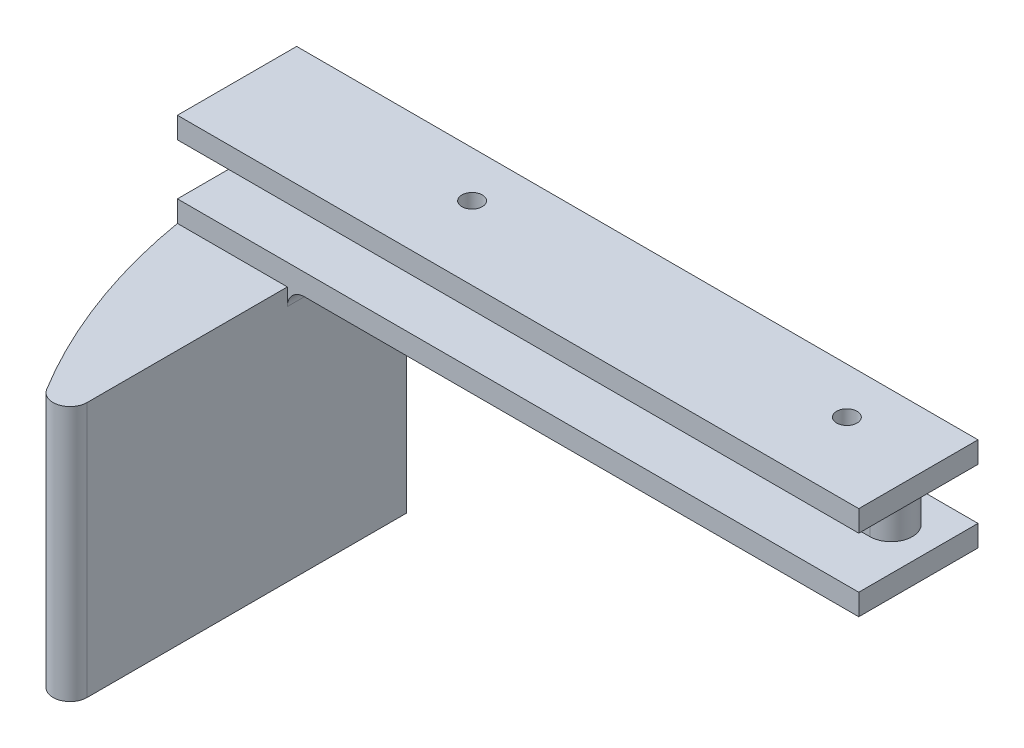
ISO-10303-21;
HEADER;
FILE_DESCRIPTION(('STEP AP214'),'2;1');
FILE_NAME('part.step','',(''),(''),'','','');
FILE_SCHEMA(('AUTOMOTIVE_DESIGN { 1 0 10303 214 1 1 1 1 }'));
ENDSEC;
DATA;
#1=APPLICATION_CONTEXT('core data for automotive mechanical design processes');
#2=APPLICATION_PROTOCOL_DEFINITION('international standard','automotive_design',2000,#1);
#3=PRODUCT_CONTEXT('',#1,'mechanical');
#4=PRODUCT('Part','Part','',(#3));
#5=PRODUCT_RELATED_PRODUCT_CATEGORY('part','',(#4));
#6=PRODUCT_DEFINITION_FORMATION('','',#4);
#7=PRODUCT_DEFINITION_CONTEXT('part definition',#1,'design');
#8=PRODUCT_DEFINITION('design','',#6,#7);
#9=PRODUCT_DEFINITION_SHAPE('','',#8);
#10=(LENGTH_UNIT() NAMED_UNIT(*) SI_UNIT(.MILLI.,.METRE.));
#11=(NAMED_UNIT(*) PLANE_ANGLE_UNIT() SI_UNIT($,.RADIAN.));
#12=(NAMED_UNIT(*) SI_UNIT($,.STERADIAN.) SOLID_ANGLE_UNIT());
#13=UNCERTAINTY_MEASURE_WITH_UNIT(LENGTH_MEASURE(1.E-05),#10,'distance_accuracy_value','');
#14=(GEOMETRIC_REPRESENTATION_CONTEXT(3) GLOBAL_UNCERTAINTY_ASSIGNED_CONTEXT((#13)) GLOBAL_UNIT_ASSIGNED_CONTEXT((#10,
#11,#12)) REPRESENTATION_CONTEXT('',''));
#15=CARTESIAN_POINT('',(0.,0.,0.));
#16=DIRECTION('',(0.,0.,1.));
#17=DIRECTION('',(1.,0.,0.));
#18=AXIS2_PLACEMENT_3D('',#15,#16,#17);
#19=CARTESIAN_POINT('',(0.,-10.795,0.));
#20=DIRECTION('',(0.,1.,0.));
#21=DIRECTION('',(0.,0.,-1.));
#22=AXIS2_PLACEMENT_3D('',#19,#20,#21);
#23=PLANE('',#22);
#24=CARTESIAN_POINT('',(88.9,-10.795,-10.922));
#25=DIRECTION('',(0.,-1.,0.));
#26=DIRECTION('',(0.,0.,-1.));
#27=AXIS2_PLACEMENT_3D('',#24,#25,#26);
#28=CIRCLE('',#27,1.52399999999999);
#29=CARTESIAN_POINT('',(88.9,-10.795,-12.446));
#30=VERTEX_POINT('',#29);
#31=EDGE_CURVE('E515',#30,#30,#28,.T.);
#32=ORIENTED_EDGE('',*,*,#31,.F.);
#33=EDGE_LOOP('',(#32));
#34=FACE_BOUND('',#33,.T.);
#35=CARTESIAN_POINT('',(33.02,-10.795,-10.922));
#36=DIRECTION('',(0.,-1.,0.));
#37=DIRECTION('',(0.,0.,-1.));
#38=AXIS2_PLACEMENT_3D('',#35,#36,#37);
#39=CIRCLE('',#38,1.524);
#40=CARTESIAN_POINT('',(33.02,-10.795,-12.446));
#41=VERTEX_POINT('',#40);
#42=EDGE_CURVE('E186',#41,#41,#39,.T.);
#43=ORIENTED_EDGE('',*,*,#42,.F.);
#44=EDGE_LOOP('',(#43));
#45=FACE_BOUND('',#44,.T.);
#46=DIRECTION('',(1.,0.,0.));
#47=VECTOR('',#46,1.);
#48=CARTESIAN_POINT('',(0.,-10.795,0.));
#49=LINE('',#48,#47);
#50=CARTESIAN_POINT('',(18.9338497528875,-10.795,0.));
#51=VERTEX_POINT('',#50);
#52=CARTESIAN_POINT('',(101.6,-10.795,0.));
#53=VERTEX_POINT('',#52);
#54=EDGE_CURVE('E203',#51,#53,#49,.T.);
#55=ORIENTED_EDGE('',*,*,#54,.F.);
#56=DIRECTION('',(0.,0.,1.));
#57=VECTOR('',#56,1.);
#58=CARTESIAN_POINT('',(18.9338497528875,-10.795,-17.78));
#59=LINE('',#58,#57);
#60=CARTESIAN_POINT('',(18.9338497528875,-10.795,-17.78));
#61=VERTEX_POINT('',#60);
#62=EDGE_CURVE('E286',#51,#61,#59,.F.);
#63=ORIENTED_EDGE('',*,*,#62,.T.);
#64=DIRECTION('',(-1.,0.,0.));
#65=VECTOR('',#64,1.);
#66=CARTESIAN_POINT('',(0.,-10.795,-17.78));
#67=LINE('',#66,#65);
#68=CARTESIAN_POINT('',(101.6,-10.795,-17.78));
#69=VERTEX_POINT('',#68);
#70=EDGE_CURVE('E196',#69,#61,#67,.T.);
#71=ORIENTED_EDGE('',*,*,#70,.F.);
#72=DIRECTION('',(0.,0.,-1.));
#73=VECTOR('',#72,1.);
#74=CARTESIAN_POINT('',(101.6,-10.795,0.));
#75=LINE('',#74,#73);
#76=EDGE_CURVE('E199',#53,#69,#75,.T.);
#77=ORIENTED_EDGE('',*,*,#76,.F.);
#78=EDGE_LOOP('',(#55,#63,#71,#77));
#79=FACE_BOUND('',#78,.T.);
#80=ADVANCED_FACE('F33',(#34,#45,#79),#23,.F.);
#81=CARTESIAN_POINT('',(0.,3.175,0.));
#82=DIRECTION('',(1.,0.,0.));
#83=DIRECTION('',(0.,0.,-1.));
#84=AXIS2_PLACEMENT_3D('',#81,#82,#83);
#85=PLANE('',#84);
#86=DIRECTION('',(0.,0.,1.));
#87=VECTOR('',#86,1.);
#88=CARTESIAN_POINT('',(0.,0.,0.));
#89=LINE('',#88,#87);
#90=CARTESIAN_POINT('',(0.,0.,-17.78));
#91=VERTEX_POINT('',#90);
#92=CARTESIAN_POINT('',(0.,0.,0.));
#93=VERTEX_POINT('',#92);
#94=EDGE_CURVE('E251',#91,#93,#89,.T.);
#95=ORIENTED_EDGE('',*,*,#94,.T.);
#96=DIRECTION('',(0.,-1.,0.));
#97=VECTOR('',#96,1.);
#98=CARTESIAN_POINT('',(0.,3.175,0.));
#99=LINE('',#98,#97);
#100=CARTESIAN_POINT('',(0.,3.175,0.));
#101=VERTEX_POINT('',#100);
#102=EDGE_CURVE('E278',#101,#93,#99,.T.);
#103=ORIENTED_EDGE('',*,*,#102,.F.);
#104=DIRECTION('',(0.,0.,1.));
#105=VECTOR('',#104,1.);
#106=CARTESIAN_POINT('',(0.,3.175,0.));
#107=LINE('',#106,#105);
#108=CARTESIAN_POINT('',(0.,3.175,-17.78));
#109=VERTEX_POINT('',#108);
#110=EDGE_CURVE('E252',#109,#101,#107,.T.);
#111=ORIENTED_EDGE('',*,*,#110,.F.);
#112=DIRECTION('',(0.,-1.,0.));
#113=VECTOR('',#112,1.);
#114=CARTESIAN_POINT('',(0.,3.175,-17.78));
#115=LINE('',#114,#113);
#116=EDGE_CURVE('E262',#109,#91,#115,.T.);
#117=ORIENTED_EDGE('',*,*,#116,.T.);
#118=EDGE_LOOP('',(#95,#103,#111,#117));
#119=FACE_BOUND('',#118,.T.);
#120=ADVANCED_FACE('F333',(#119),#85,.F.);
#121=CARTESIAN_POINT('',(0.,3.175,0.));
#122=DIRECTION('',(0.,0.,-1.));
#123=DIRECTION('',(-1.,0.,0.));
#124=AXIS2_PLACEMENT_3D('',#121,#122,#123);
#125=PLANE('',#124);
#126=DIRECTION('',(1.,0.,0.));
#127=VECTOR('',#126,1.);
#128=CARTESIAN_POINT('',(0.,0.,0.));
#129=LINE('',#128,#127);
#130=CARTESIAN_POINT('',(101.6,0.,0.));
#131=VERTEX_POINT('',#130);
#132=EDGE_CURVE('E265',#93,#131,#129,.T.);
#133=ORIENTED_EDGE('',*,*,#132,.T.);
#134=DIRECTION('',(0.,-1.,0.));
#135=VECTOR('',#134,1.);
#136=CARTESIAN_POINT('',(101.6,3.175,0.));
#137=LINE('',#136,#135);
#138=CARTESIAN_POINT('',(101.6,3.175,0.));
#139=VERTEX_POINT('',#138);
#140=EDGE_CURVE('E275',#139,#131,#137,.T.);
#141=ORIENTED_EDGE('',*,*,#140,.F.);
#142=DIRECTION('',(1.,0.,0.));
#143=VECTOR('',#142,1.);
#144=CARTESIAN_POINT('',(0.,3.175,0.));
#145=LINE('',#144,#143);
#146=EDGE_CURVE('E255',#101,#139,#145,.T.);
#147=ORIENTED_EDGE('',*,*,#146,.F.);
#148=ORIENTED_EDGE('',*,*,#102,.T.);
#149=EDGE_LOOP('',(#133,#141,#147,#148));
#150=FACE_BOUND('',#149,.T.);
#151=ADVANCED_FACE('F339',(#150),#125,.F.);
#152=CARTESIAN_POINT('',(101.6,3.175,0.));
#153=DIRECTION('',(-1.,0.,0.));
#154=DIRECTION('',(0.,0.,1.));
#155=AXIS2_PLACEMENT_3D('',#152,#153,#154);
#156=PLANE('',#155);
#157=DIRECTION('',(0.,0.,-1.));
#158=VECTOR('',#157,1.);
#159=CARTESIAN_POINT('',(101.6,0.,0.));
#160=LINE('',#159,#158);
#161=CARTESIAN_POINT('',(101.6,0.,-17.78));
#162=VERTEX_POINT('',#161);
#163=EDGE_CURVE('E267',#131,#162,#160,.T.);
#164=ORIENTED_EDGE('',*,*,#163,.T.);
#165=DIRECTION('',(0.,-1.,0.));
#166=VECTOR('',#165,1.);
#167=CARTESIAN_POINT('',(101.6,3.175,-17.78));
#168=LINE('',#167,#166);
#169=CARTESIAN_POINT('',(101.6,3.175,-17.78));
#170=VERTEX_POINT('',#169);
#171=EDGE_CURVE('E272',#170,#162,#168,.T.);
#172=ORIENTED_EDGE('',*,*,#171,.F.);
#173=DIRECTION('',(0.,0.,-1.));
#174=VECTOR('',#173,1.);
#175=CARTESIAN_POINT('',(101.6,3.175,0.));
#176=LINE('',#175,#174);
#177=EDGE_CURVE('E258',#139,#170,#176,.T.);
#178=ORIENTED_EDGE('',*,*,#177,.F.);
#179=ORIENTED_EDGE('',*,*,#140,.T.);
#180=EDGE_LOOP('',(#164,#172,#178,#179));
#181=FACE_BOUND('',#180,.T.);
#182=ADVANCED_FACE('F385',(#181),#156,.F.);
#183=CARTESIAN_POINT('',(0.,3.175,-17.78));
#184=DIRECTION('',(0.,0.,1.));
#185=DIRECTION('',(1.,0.,0.));
#186=AXIS2_PLACEMENT_3D('',#183,#184,#185);
#187=PLANE('',#186);
#188=DIRECTION('',(-1.,0.,0.));
#189=VECTOR('',#188,1.);
#190=CARTESIAN_POINT('',(0.,0.,-17.78));
#191=LINE('',#190,#189);
#192=EDGE_CURVE('E256',#162,#91,#191,.T.);
#193=ORIENTED_EDGE('',*,*,#192,.T.);
#194=ORIENTED_EDGE('',*,*,#116,.F.);
#195=DIRECTION('',(-1.,0.,0.));
#196=VECTOR('',#195,1.);
#197=CARTESIAN_POINT('',(0.,3.175,-17.78));
#198=LINE('',#197,#196);
#199=EDGE_CURVE('E260',#170,#109,#198,.T.);
#200=ORIENTED_EDGE('',*,*,#199,.F.);
#201=ORIENTED_EDGE('',*,*,#171,.T.);
#202=EDGE_LOOP('',(#193,#194,#200,#201));
#203=FACE_BOUND('',#202,.T.);
#204=ADVANCED_FACE('F378',(#203),#187,.F.);
#205=CARTESIAN_POINT('',(0.,3.175,0.));
#206=DIRECTION('',(0.,-1.,0.));
#207=DIRECTION('',(0.,0.,-1.));
#208=AXIS2_PLACEMENT_3D('',#205,#206,#207);
#209=PLANE('',#208);
#210=CARTESIAN_POINT('',(88.9,3.175,-10.922));
#211=DIRECTION('',(0.,-1.,0.));
#212=DIRECTION('',(0.,0.,-1.));
#213=AXIS2_PLACEMENT_3D('',#210,#211,#212);
#214=CIRCLE('',#213,1.52399999999999);
#215=CARTESIAN_POINT('',(88.9,3.175,-12.446));
#216=VERTEX_POINT('',#215);
#217=EDGE_CURVE('E192',#216,#216,#214,.T.);
#218=ORIENTED_EDGE('',*,*,#217,.T.);
#219=EDGE_LOOP('',(#218));
#220=FACE_BOUND('',#219,.T.);
#221=CARTESIAN_POINT('',(33.02,3.175,-10.922));
#222=DIRECTION('',(0.,-1.,0.));
#223=DIRECTION('',(0.,0.,-1.));
#224=AXIS2_PLACEMENT_3D('',#221,#222,#223);
#225=CIRCLE('',#224,1.524);
#226=CARTESIAN_POINT('',(33.02,3.175,-12.446));
#227=VERTEX_POINT('',#226);
#228=EDGE_CURVE('E516',#227,#227,#225,.T.);
#229=ORIENTED_EDGE('',*,*,#228,.T.);
#230=EDGE_LOOP('',(#229));
#231=FACE_BOUND('',#230,.T.);
#232=ORIENTED_EDGE('',*,*,#110,.T.);
#233=ORIENTED_EDGE('',*,*,#146,.T.);
#234=ORIENTED_EDGE('',*,*,#177,.T.);
#235=ORIENTED_EDGE('',*,*,#199,.T.);
#236=EDGE_LOOP('',(#232,#233,#234,#235));
#237=FACE_BOUND('',#236,.T.);
#238=ADVANCED_FACE('F375',(#220,#231,#237),#209,.F.);
#239=CARTESIAN_POINT('',(0.,0.,0.));
#240=DIRECTION('',(0.,-1.,0.));
#241=DIRECTION('',(0.,0.,-1.));
#242=AXIS2_PLACEMENT_3D('',#239,#240,#241);
#243=PLANE('',#242);
#244=CARTESIAN_POINT('',(95.25,0.,-11.176));
#245=DIRECTION('',(0.,-1.,0.));
#246=DIRECTION('',(0.,0.,-1.));
#247=AXIS2_PLACEMENT_3D('',#244,#245,#246);
#248=CIRCLE('',#247,3.175);
#249=CARTESIAN_POINT('',(95.25,0.,-14.351));
#250=VERTEX_POINT('',#249);
#251=CARTESIAN_POINT('',(95.25,0.,-8.00099999999999));
#252=VERTEX_POINT('',#251);
#253=EDGE_CURVE('E166',#250,#252,#248,.T.);
#254=ORIENTED_EDGE('',*,*,#253,.F.);
#255=DIRECTION('',(-1.,0.,0.));
#256=VECTOR('',#255,1.);
#257=CARTESIAN_POINT('',(95.25,0.,-14.351));
#258=LINE('',#257,#256);
#259=CARTESIAN_POINT('',(6.35,0.,-14.351));
#260=VERTEX_POINT('',#259);
#261=EDGE_CURVE('E223',#250,#260,#258,.T.);
#262=ORIENTED_EDGE('',*,*,#261,.T.);
#263=CARTESIAN_POINT('',(6.35,0.,-11.176));
#264=DIRECTION('',(0.,-1.,0.));
#265=DIRECTION('',(0.,0.,-1.));
#266=AXIS2_PLACEMENT_3D('',#263,#264,#265);
#267=CIRCLE('',#266,3.175);
#268=CARTESIAN_POINT('',(6.35,0.,-8.001));
#269=VERTEX_POINT('',#268);
#270=EDGE_CURVE('E236',#269,#260,#267,.T.);
#271=ORIENTED_EDGE('',*,*,#270,.F.);
#272=DIRECTION('',(-1.,0.,0.));
#273=VECTOR('',#272,1.);
#274=CARTESIAN_POINT('',(95.25,0.,-8.00099999999999));
#275=LINE('',#274,#273);
#276=EDGE_CURVE('E233',#252,#269,#275,.T.);
#277=ORIENTED_EDGE('',*,*,#276,.F.);
#278=EDGE_LOOP('',(#254,#262,#271,#277));
#279=FACE_BOUND('',#278,.T.);
#280=ORIENTED_EDGE('',*,*,#94,.F.);
#281=ORIENTED_EDGE('',*,*,#192,.F.);
#282=ORIENTED_EDGE('',*,*,#163,.F.);
#283=ORIENTED_EDGE('',*,*,#132,.F.);
#284=EDGE_LOOP('',(#280,#281,#282,#283));
#285=FACE_BOUND('',#284,.T.);
#286=ADVANCED_FACE('F373',(#279,#285),#243,.T.);
#287=CARTESIAN_POINT('',(95.25,-7.62,-11.176));
#288=DIRECTION('',(0.,1.,0.));
#289=DIRECTION('',(0.,0.,1.));
#290=AXIS2_PLACEMENT_3D('',#287,#288,#289);
#291=CYLINDRICAL_SURFACE('',#290,3.175);
#292=ORIENTED_EDGE('',*,*,#253,.T.);
#293=DIRECTION('',(0.,1.,0.));
#294=VECTOR('',#293,1.);
#295=CARTESIAN_POINT('',(95.25,-7.62,-8.00099999999999));
#296=LINE('',#295,#294);
#297=CARTESIAN_POINT('',(95.25,-7.62,-8.00099999999999));
#298=VERTEX_POINT('',#297);
#299=EDGE_CURVE('E248',#298,#252,#296,.T.);
#300=ORIENTED_EDGE('',*,*,#299,.F.);
#301=CARTESIAN_POINT('',(95.25,-7.62,-11.176));
#302=DIRECTION('',(0.,-1.,0.));
#303=DIRECTION('',(0.,0.,-1.));
#304=AXIS2_PLACEMENT_3D('',#301,#302,#303);
#305=CIRCLE('',#304,3.175);
#306=CARTESIAN_POINT('',(95.25,-7.62,-14.351));
#307=VERTEX_POINT('',#306);
#308=EDGE_CURVE('E220',#307,#298,#305,.T.);
#309=ORIENTED_EDGE('',*,*,#308,.F.);
#310=DIRECTION('',(0.,1.,0.));
#311=VECTOR('',#310,1.);
#312=CARTESIAN_POINT('',(95.25,-7.62,-14.351));
#313=LINE('',#312,#311);
#314=EDGE_CURVE('E230',#307,#250,#313,.T.);
#315=ORIENTED_EDGE('',*,*,#314,.T.);
#316=EDGE_LOOP('',(#292,#300,#309,#315));
#317=FACE_BOUND('',#316,.T.);
#318=ADVANCED_FACE('F369',(#317),#291,.T.);
#319=CARTESIAN_POINT('',(95.25,-7.62,-8.00099999999999));
#320=DIRECTION('',(0.,0.,-1.));
#321=DIRECTION('',(-1.,0.,0.));
#322=AXIS2_PLACEMENT_3D('',#319,#320,#321);
#323=PLANE('',#322);
#324=ORIENTED_EDGE('',*,*,#276,.T.);
#325=DIRECTION('',(0.,1.,0.));
#326=VECTOR('',#325,1.);
#327=CARTESIAN_POINT('',(6.35,-7.62,-8.001));
#328=LINE('',#327,#326);
#329=CARTESIAN_POINT('',(6.35,-7.62,-8.001));
#330=VERTEX_POINT('',#329);
#331=EDGE_CURVE('E245',#330,#269,#328,.T.);
#332=ORIENTED_EDGE('',*,*,#331,.F.);
#333=DIRECTION('',(-1.,0.,0.));
#334=VECTOR('',#333,1.);
#335=CARTESIAN_POINT('',(95.25,-7.62,-8.00099999999999));
#336=LINE('',#335,#334);
#337=EDGE_CURVE('E222',#298,#330,#336,.T.);
#338=ORIENTED_EDGE('',*,*,#337,.F.);
#339=ORIENTED_EDGE('',*,*,#299,.T.);
#340=EDGE_LOOP('',(#324,#332,#338,#339));
#341=FACE_BOUND('',#340,.T.);
#342=ADVANCED_FACE('F365',(#341),#323,.F.);
#343=CARTESIAN_POINT('',(6.35,-7.62,-11.176));
#344=DIRECTION('',(0.,1.,0.));
#345=DIRECTION('',(0.,0.,1.));
#346=AXIS2_PLACEMENT_3D('',#343,#344,#345);
#347=CYLINDRICAL_SURFACE('',#346,3.175);
#348=ORIENTED_EDGE('',*,*,#270,.T.);
#349=DIRECTION('',(0.,1.,0.));
#350=VECTOR('',#349,1.);
#351=CARTESIAN_POINT('',(6.35,-7.62,-14.351));
#352=LINE('',#351,#350);
#353=CARTESIAN_POINT('',(6.35,-7.62,-14.351));
#354=VERTEX_POINT('',#353);
#355=EDGE_CURVE('E242',#354,#260,#352,.T.);
#356=ORIENTED_EDGE('',*,*,#355,.F.);
#357=CARTESIAN_POINT('',(6.35,-7.62,-11.176));
#358=DIRECTION('',(0.,-1.,0.));
#359=DIRECTION('',(0.,0.,-1.));
#360=AXIS2_PLACEMENT_3D('',#357,#358,#359);
#361=CIRCLE('',#360,3.175);
#362=EDGE_CURVE('E225',#330,#354,#361,.T.);
#363=ORIENTED_EDGE('',*,*,#362,.F.);
#364=ORIENTED_EDGE('',*,*,#331,.T.);
#365=EDGE_LOOP('',(#348,#356,#363,#364));
#366=FACE_BOUND('',#365,.T.);
#367=ADVANCED_FACE('F361',(#366),#347,.T.);
#368=CARTESIAN_POINT('',(95.25,-7.62,-14.351));
#369=DIRECTION('',(0.,0.,-1.));
#370=DIRECTION('',(-1.,0.,0.));
#371=AXIS2_PLACEMENT_3D('',#368,#369,#370);
#372=PLANE('',#371);
#373=ORIENTED_EDGE('',*,*,#261,.F.);
#374=ORIENTED_EDGE('',*,*,#314,.F.);
#375=DIRECTION('',(-1.,0.,0.));
#376=VECTOR('',#375,1.);
#377=CARTESIAN_POINT('',(95.25,-7.62,-14.351));
#378=LINE('',#377,#376);
#379=EDGE_CURVE('E227',#307,#354,#378,.T.);
#380=ORIENTED_EDGE('',*,*,#379,.T.);
#381=ORIENTED_EDGE('',*,*,#355,.T.);
#382=EDGE_LOOP('',(#373,#374,#380,#381));
#383=FACE_BOUND('',#382,.T.);
#384=ADVANCED_FACE('F358',(#383),#372,.T.);
#385=CARTESIAN_POINT('',(0.,-10.795,0.));
#386=DIRECTION('',(-1.,0.,0.));
#387=DIRECTION('',(0.,0.,1.));
#388=AXIS2_PLACEMENT_3D('',#385,#386,#387);
#389=PLANE('',#388);
#390=DIRECTION('',(0.,0.,1.));
#391=VECTOR('',#390,1.);
#392=CARTESIAN_POINT('',(0.,-7.62,0.));
#393=LINE('',#392,#391);
#394=CARTESIAN_POINT('',(0.,-7.62,-17.78));
#395=VERTEX_POINT('',#394);
#396=CARTESIAN_POINT('',(0.,-7.62,0.));
#397=VERTEX_POINT('',#396);
#398=EDGE_CURVE('E162',#395,#397,#393,.T.);
#399=ORIENTED_EDGE('',*,*,#398,.F.);
#400=DIRECTION('',(0.,1.,0.));
#401=VECTOR('',#400,1.);
#402=CARTESIAN_POINT('',(0.,-10.795,-17.78));
#403=LINE('',#402,#401);
#404=CARTESIAN_POINT('',(0.,-48.895,-17.78));
#405=VERTEX_POINT('',#404);
#406=EDGE_CURVE('E155',#405,#395,#403,.T.);
#407=ORIENTED_EDGE('',*,*,#406,.F.);
#408=DIRECTION('',(0.,0.,-1.));
#409=VECTOR('',#408,1.);
#410=CARTESIAN_POINT('',(0.,-48.895,-17.78));
#411=LINE('',#410,#409);
#412=CARTESIAN_POINT('',(0.,-48.895,0.));
#413=VERTEX_POINT('',#412);
#414=EDGE_CURVE('E160',#413,#405,#411,.T.);
#415=ORIENTED_EDGE('',*,*,#414,.F.);
#416=DIRECTION('',(0.,1.,0.));
#417=VECTOR('',#416,1.);
#418=CARTESIAN_POINT('',(0.,-48.895,0.));
#419=LINE('',#418,#417);
#420=CARTESIAN_POINT('',(0.,-10.795,0.));
#421=VERTEX_POINT('',#420);
#422=EDGE_CURVE('E191',#413,#421,#419,.T.);
#423=ORIENTED_EDGE('',*,*,#422,.T.);
#424=DIRECTION('',(0.,1.,0.));
#425=VECTOR('',#424,1.);
#426=CARTESIAN_POINT('',(0.,-10.795,0.));
#427=LINE('',#426,#425);
#428=EDGE_CURVE('E207',#421,#397,#427,.T.);
#429=ORIENTED_EDGE('',*,*,#428,.T.);
#430=EDGE_LOOP('',(#399,#407,#415,#423,#429));
#431=FACE_BOUND('',#430,.T.);
#432=ADVANCED_FACE('F157',(#431),#389,.T.);
#433=CARTESIAN_POINT('',(0.,-10.795,-17.78));
#434=DIRECTION('',(0.,0.,-1.));
#435=DIRECTION('',(-1.,0.,0.));
#436=AXIS2_PLACEMENT_3D('',#433,#434,#435);
#437=PLANE('',#436);
#438=DIRECTION('',(-1.,0.,0.));
#439=VECTOR('',#438,1.);
#440=CARTESIAN_POINT('',(0.,-7.62,-17.78));
#441=LINE('',#440,#439);
#442=CARTESIAN_POINT('',(101.6,-7.62,-17.78));
#443=VERTEX_POINT('',#442);
#444=EDGE_CURVE('E209',#443,#395,#441,.T.);
#445=ORIENTED_EDGE('',*,*,#444,.F.);
#446=DIRECTION('',(0.,1.,0.));
#447=VECTOR('',#446,1.);
#448=CARTESIAN_POINT('',(101.6,-10.795,-17.78));
#449=LINE('',#448,#447);
#450=EDGE_CURVE('E167',#69,#443,#449,.T.);
#451=ORIENTED_EDGE('',*,*,#450,.F.);
#452=ORIENTED_EDGE('',*,*,#70,.T.);
#453=CARTESIAN_POINT('',(18.9338497528875,-13.335,-17.78));
#454=DIRECTION('',(0.,0.,-1.));
#455=DIRECTION('',(-1.,0.,0.));
#456=AXIS2_PLACEMENT_3D('',#453,#454,#455);
#457=CIRCLE('',#456,2.54);
#458=CARTESIAN_POINT('',(16.3938497528875,-13.335,-17.78));
#459=VERTEX_POINT('',#458);
#460=EDGE_CURVE('E290',#61,#459,#457,.F.);
#461=ORIENTED_EDGE('',*,*,#460,.T.);
#462=DIRECTION('',(0.,1.,0.));
#463=VECTOR('',#462,1.);
#464=CARTESIAN_POINT('',(16.3938497528875,-48.895,-17.78));
#465=LINE('',#464,#463);
#466=CARTESIAN_POINT('',(16.3938497528875,-48.895,-17.78));
#467=VERTEX_POINT('',#466);
#468=EDGE_CURVE('E173',#467,#459,#465,.T.);
#469=ORIENTED_EDGE('',*,*,#468,.F.);
#470=DIRECTION('',(1.,0.,0.));
#471=VECTOR('',#470,1.);
#472=CARTESIAN_POINT('',(0.,-48.895,-17.78));
#473=LINE('',#472,#471);
#474=EDGE_CURVE('E170',#405,#467,#473,.T.);
#475=ORIENTED_EDGE('',*,*,#474,.F.);
#476=ORIENTED_EDGE('',*,*,#406,.T.);
#477=EDGE_LOOP('',(#445,#451,#452,#461,#469,#475,#476));
#478=FACE_BOUND('',#477,.T.);
#479=ADVANCED_FACE('F171',(#478),#437,.T.);
#480=CARTESIAN_POINT('',(101.6,-10.795,0.));
#481=DIRECTION('',(1.,0.,0.));
#482=DIRECTION('',(0.,0.,-1.));
#483=AXIS2_PLACEMENT_3D('',#480,#481,#482);
#484=PLANE('',#483);
#485=DIRECTION('',(0.,0.,-1.));
#486=VECTOR('',#485,1.);
#487=CARTESIAN_POINT('',(101.6,-7.62,0.));
#488=LINE('',#487,#486);
#489=CARTESIAN_POINT('',(101.6,-7.62,0.));
#490=VERTEX_POINT('',#489);
#491=EDGE_CURVE('E211',#490,#443,#488,.T.);
#492=ORIENTED_EDGE('',*,*,#491,.F.);
#493=DIRECTION('',(0.,1.,0.));
#494=VECTOR('',#493,1.);
#495=CARTESIAN_POINT('',(101.6,-10.795,0.));
#496=LINE('',#495,#494);
#497=EDGE_CURVE('E217',#53,#490,#496,.T.);
#498=ORIENTED_EDGE('',*,*,#497,.F.);
#499=ORIENTED_EDGE('',*,*,#76,.T.);
#500=ORIENTED_EDGE('',*,*,#450,.T.);
#501=EDGE_LOOP('',(#492,#498,#499,#500));
#502=FACE_BOUND('',#501,.T.);
#503=ADVANCED_FACE('F314',(#502),#484,.T.);
#504=CARTESIAN_POINT('',(0.,-10.795,0.));
#505=DIRECTION('',(0.,0.,1.));
#506=DIRECTION('',(1.,0.,0.));
#507=AXIS2_PLACEMENT_3D('',#504,#505,#506);
#508=PLANE('',#507);
#509=DIRECTION('',(1.,0.,0.));
#510=VECTOR('',#509,1.);
#511=CARTESIAN_POINT('',(0.,-7.62,0.));
#512=LINE('',#511,#510);
#513=EDGE_CURVE('E200',#397,#490,#512,.T.);
#514=ORIENTED_EDGE('',*,*,#513,.F.);
#515=ORIENTED_EDGE('',*,*,#428,.F.);
#516=CARTESIAN_POINT('',(16.3938497528875,-10.795,0.));
#517=VERTEX_POINT('',#516);
#518=EDGE_CURVE('E204',#421,#517,#49,.T.);
#519=ORIENTED_EDGE('',*,*,#518,.T.);
#520=DIRECTION('',(0.,1.,0.));
#521=VECTOR('',#520,1.);
#522=CARTESIAN_POINT('',(16.3938497528875,-48.895,0.));
#523=LINE('',#522,#521);
#524=CARTESIAN_POINT('',(16.3938497528875,-13.335,0.));
#525=VERTEX_POINT('',#524);
#526=EDGE_CURVE('E281',#525,#517,#523,.T.);
#527=ORIENTED_EDGE('',*,*,#526,.F.);
#528=CARTESIAN_POINT('',(18.9338497528875,-13.335,0.));
#529=DIRECTION('',(0.,0.,1.));
#530=DIRECTION('',(1.,0.,0.));
#531=AXIS2_PLACEMENT_3D('',#528,#529,#530);
#532=CIRCLE('',#531,2.54);
#533=EDGE_CURVE('E288',#525,#51,#532,.F.);
#534=ORIENTED_EDGE('',*,*,#533,.T.);
#535=ORIENTED_EDGE('',*,*,#54,.T.);
#536=ORIENTED_EDGE('',*,*,#497,.T.);
#537=EDGE_LOOP('',(#514,#515,#519,#527,#534,#535,#536));
#538=FACE_BOUND('',#537,.T.);
#539=ADVANCED_FACE('F308',(#538),#508,.T.);
#540=CARTESIAN_POINT('',(0.,-7.62,0.));
#541=DIRECTION('',(0.,1.,0.));
#542=DIRECTION('',(0.,0.,-1.));
#543=AXIS2_PLACEMENT_3D('',#540,#541,#542);
#544=PLANE('',#543);
#545=ORIENTED_EDGE('',*,*,#379,.F.);
#546=ORIENTED_EDGE('',*,*,#308,.T.);
#547=ORIENTED_EDGE('',*,*,#337,.T.);
#548=ORIENTED_EDGE('',*,*,#362,.T.);
#549=EDGE_LOOP('',(#545,#546,#547,#548));
#550=FACE_BOUND('',#549,.T.);
#551=ORIENTED_EDGE('',*,*,#398,.T.);
#552=ORIENTED_EDGE('',*,*,#513,.T.);
#553=ORIENTED_EDGE('',*,*,#491,.T.);
#554=ORIENTED_EDGE('',*,*,#444,.T.);
#555=EDGE_LOOP('',(#551,#552,#553,#554));
#556=FACE_BOUND('',#555,.T.);
#557=ADVANCED_FACE('F307',(#550,#556),#544,.T.);
#558=CARTESIAN_POINT('',(86.3750670798447,-10.795,-14.5888639696175));
#559=DIRECTION('',(0.,1.,0.));
#560=DIRECTION('',(0.,0.,1.));
#561=AXIS2_PLACEMENT_3D('',#558,#559,#560);
#562=PLANE('',#561);
#563=CARTESIAN_POINT('',(86.3750670798447,-10.795,-14.5888639696175));
#564=DIRECTION('',(0.,-1.,0.));
#565=DIRECTION('',(0.,0.,1.));
#566=AXIS2_PLACEMENT_3D('',#563,#564,#565);
#567=CIRCLE('',#566,87.5984427085989);
#568=CARTESIAN_POINT('',(11.6882341344411,-10.795,31.1862837587847));
#569=VERTEX_POINT('',#568);
#570=EDGE_CURVE('E181',#569,#421,#567,.T.);
#571=ORIENTED_EDGE('',*,*,#570,.F.);
#572=CARTESIAN_POINT('',(13.8538497528875,-10.795,29.8589898979005));
#573=DIRECTION('',(0.,1.,0.));
#574=DIRECTION('',(0.,0.,1.));
#575=AXIS2_PLACEMENT_3D('',#572,#573,#574);
#576=CIRCLE('',#575,2.54);
#577=CARTESIAN_POINT('',(16.3938497528875,-10.795,29.8589898979005));
#578=VERTEX_POINT('',#577);
#579=EDGE_CURVE('E55',#569,#578,#576,.T.);
#580=ORIENTED_EDGE('',*,*,#579,.T.);
#581=DIRECTION('',(0.,0.,1.));
#582=VECTOR('',#581,1.);
#583=CARTESIAN_POINT('',(16.3938497528875,-10.795,0.));
#584=LINE('',#583,#582);
#585=EDGE_CURVE('E183',#517,#578,#584,.T.);
#586=ORIENTED_EDGE('',*,*,#585,.F.);
#587=ORIENTED_EDGE('',*,*,#518,.F.);
#588=EDGE_LOOP('',(#571,#580,#586,#587));
#589=FACE_BOUND('',#588,.T.);
#590=ADVANCED_FACE('F302',(#589),#562,.T.);
#591=CARTESIAN_POINT('',(16.3938497528875,-48.895,0.));
#592=DIRECTION('',(-1.,0.,0.));
#593=DIRECTION('',(0.,0.,1.));
#594=AXIS2_PLACEMENT_3D('',#591,#592,#593);
#595=PLANE('',#594);
#596=ORIENTED_EDGE('',*,*,#585,.T.);
#597=DIRECTION('',(0.,1.,0.));
#598=VECTOR('',#597,1.);
#599=CARTESIAN_POINT('',(16.3938497528875,-48.895,29.8589898979005));
#600=LINE('',#599,#598);
#601=CARTESIAN_POINT('',(16.3938497528875,-48.895,29.8589898979005));
#602=VERTEX_POINT('',#601);
#603=EDGE_CURVE('E41',#578,#602,#600,.F.);
#604=ORIENTED_EDGE('',*,*,#603,.T.);
#605=DIRECTION('',(0.,0.,1.));
#606=VECTOR('',#605,1.);
#607=CARTESIAN_POINT('',(16.3938497528875,-48.895,-17.78));
#608=LINE('',#607,#606);
#609=EDGE_CURVE('E175',#467,#602,#608,.T.);
#610=ORIENTED_EDGE('',*,*,#609,.F.);
#611=ORIENTED_EDGE('',*,*,#468,.T.);
#612=DIRECTION('',(0.,0.,1.));
#613=VECTOR('',#612,1.);
#614=CARTESIAN_POINT('',(16.3938497528875,-13.335,0.));
#615=LINE('',#614,#613);
#616=EDGE_CURVE('E283',#459,#525,#615,.T.);
#617=ORIENTED_EDGE('',*,*,#616,.T.);
#618=ORIENTED_EDGE('',*,*,#526,.T.);
#619=EDGE_LOOP('',(#596,#604,#610,#611,#617,#618));
#620=FACE_BOUND('',#619,.T.);
#621=ADVANCED_FACE('F322',(#620),#595,.F.);
#622=CARTESIAN_POINT('',(86.3750670798447,-48.895,-14.5888639696175));
#623=DIRECTION('',(0.,1.,0.));
#624=DIRECTION('',(0.,0.,1.));
#625=AXIS2_PLACEMENT_3D('',#622,#623,#624);
#626=CYLINDRICAL_SURFACE('',#625,87.5984427085989);
#627=CARTESIAN_POINT('',(86.3750670798447,-48.895,-14.5888639696175));
#628=DIRECTION('',(0.,-1.,0.));
#629=DIRECTION('',(0.,0.,1.));
#630=AXIS2_PLACEMENT_3D('',#627,#628,#629);
#631=CIRCLE('',#630,87.5984427085989);
#632=CARTESIAN_POINT('',(11.6882341344411,-48.895,31.1862837587847));
#633=VERTEX_POINT('',#632);
#634=EDGE_CURVE('E179',#633,#413,#631,.T.);
#635=ORIENTED_EDGE('',*,*,#634,.F.);
#636=DIRECTION('',(0.,1.,0.));
#637=VECTOR('',#636,1.);
#638=CARTESIAN_POINT('',(11.6882341344411,-48.895,31.1862837587847));
#639=LINE('',#638,#637);
#640=EDGE_CURVE('E292',#633,#569,#639,.T.);
#641=ORIENTED_EDGE('',*,*,#640,.T.);
#642=ORIENTED_EDGE('',*,*,#570,.T.);
#643=ORIENTED_EDGE('',*,*,#422,.F.);
#644=EDGE_LOOP('',(#635,#641,#642,#643));
#645=FACE_BOUND('',#644,.T.);
#646=ADVANCED_FACE('F297',(#645),#626,.T.);
#647=CARTESIAN_POINT('',(86.3750670798447,-48.895,-14.5888639696175));
#648=DIRECTION('',(0.,1.,0.));
#649=DIRECTION('',(0.,0.,1.));
#650=AXIS2_PLACEMENT_3D('',#647,#648,#649);
#651=PLANE('',#650);
#652=ORIENTED_EDGE('',*,*,#609,.T.);
#653=CARTESIAN_POINT('',(13.8538497528875,-48.895,29.8589898979005));
#654=DIRECTION('',(0.,1.,0.));
#655=DIRECTION('',(0.,0.,1.));
#656=AXIS2_PLACEMENT_3D('',#653,#654,#655);
#657=CIRCLE('',#656,2.54);
#658=EDGE_CURVE('E11',#602,#633,#657,.F.);
#659=ORIENTED_EDGE('',*,*,#658,.T.);
#660=ORIENTED_EDGE('',*,*,#634,.T.);
#661=ORIENTED_EDGE('',*,*,#414,.T.);
#662=ORIENTED_EDGE('',*,*,#474,.T.);
#663=EDGE_LOOP('',(#652,#659,#660,#661,#662));
#664=FACE_BOUND('',#663,.T.);
#665=ADVANCED_FACE('F177',(#664),#651,.F.);
#666=CARTESIAN_POINT('',(18.9338497528875,-13.335,0.));
#667=DIRECTION('',(0.,0.,-1.));
#668=DIRECTION('',(-1.,0.,0.));
#669=AXIS2_PLACEMENT_3D('',#666,#667,#668);
#670=CYLINDRICAL_SURFACE('',#669,2.54);
#671=ORIENTED_EDGE('',*,*,#460,.F.);
#672=ORIENTED_EDGE('',*,*,#62,.F.);
#673=ORIENTED_EDGE('',*,*,#533,.F.);
#674=ORIENTED_EDGE('',*,*,#616,.F.);
#675=EDGE_LOOP('',(#671,#672,#673,#674));
#676=FACE_BOUND('',#675,.T.);
#677=ADVANCED_FACE('F320',(#676),#670,.F.);
#678=CARTESIAN_POINT('',(13.8538497528875,-48.895,29.8589898979005));
#679=DIRECTION('',(0.,1.,0.));
#680=DIRECTION('',(0.,0.,1.));
#681=AXIS2_PLACEMENT_3D('',#678,#679,#680);
#682=CYLINDRICAL_SURFACE('',#681,2.54);
#683=ORIENTED_EDGE('',*,*,#658,.F.);
#684=ORIENTED_EDGE('',*,*,#603,.F.);
#685=ORIENTED_EDGE('',*,*,#579,.F.);
#686=ORIENTED_EDGE('',*,*,#640,.F.);
#687=EDGE_LOOP('',(#683,#684,#685,#686));
#688=FACE_BOUND('',#687,.T.);
#689=ADVANCED_FACE('F35',(#688),#682,.T.);
#690=CARTESIAN_POINT('',(33.02,3.175,-10.922));
#691=DIRECTION('',(0.,-1.,0.));
#692=DIRECTION('',(0.,0.,-1.));
#693=AXIS2_PLACEMENT_3D('',#690,#691,#692);
#694=CYLINDRICAL_SURFACE('',#693,1.524);
#695=ORIENTED_EDGE('',*,*,#228,.F.);
#696=EDGE_LOOP('',(#695));
#697=FACE_BOUND('',#696,.T.);
#698=ORIENTED_EDGE('',*,*,#42,.T.);
#699=EDGE_LOOP('',(#698));
#700=FACE_BOUND('',#699,.T.);
#701=ADVANCED_FACE('F324',(#697,#700),#694,.F.);
#702=CARTESIAN_POINT('',(88.9,3.175,-10.922));
#703=DIRECTION('',(0.,-1.,0.));
#704=DIRECTION('',(0.,0.,-1.));
#705=AXIS2_PLACEMENT_3D('',#702,#703,#704);
#706=CYLINDRICAL_SURFACE('',#705,1.52399999999999);
#707=ORIENTED_EDGE('',*,*,#217,.F.);
#708=EDGE_LOOP('',(#707));
#709=FACE_BOUND('',#708,.T.);
#710=ORIENTED_EDGE('',*,*,#31,.T.);
#711=EDGE_LOOP('',(#710));
#712=FACE_BOUND('',#711,.T.);
#713=ADVANCED_FACE('F329',(#709,#712),#706,.F.);
#714=CLOSED_SHELL('',(#80,#120,#151,#182,#204,#238,#286,#318,#342,#367,#384,#432,#479,#503,#539,
#557,#590,#621,#646,#665,#677,#689,#701,#713));
#715=MANIFOLD_SOLID_BREP('B2',#714);
#716=ADVANCED_BREP_SHAPE_REPRESENTATION('',(#18,#715),#14);
#717=SHAPE_DEFINITION_REPRESENTATION(#9,#716);
ENDSEC;
END-ISO-10303-21;
